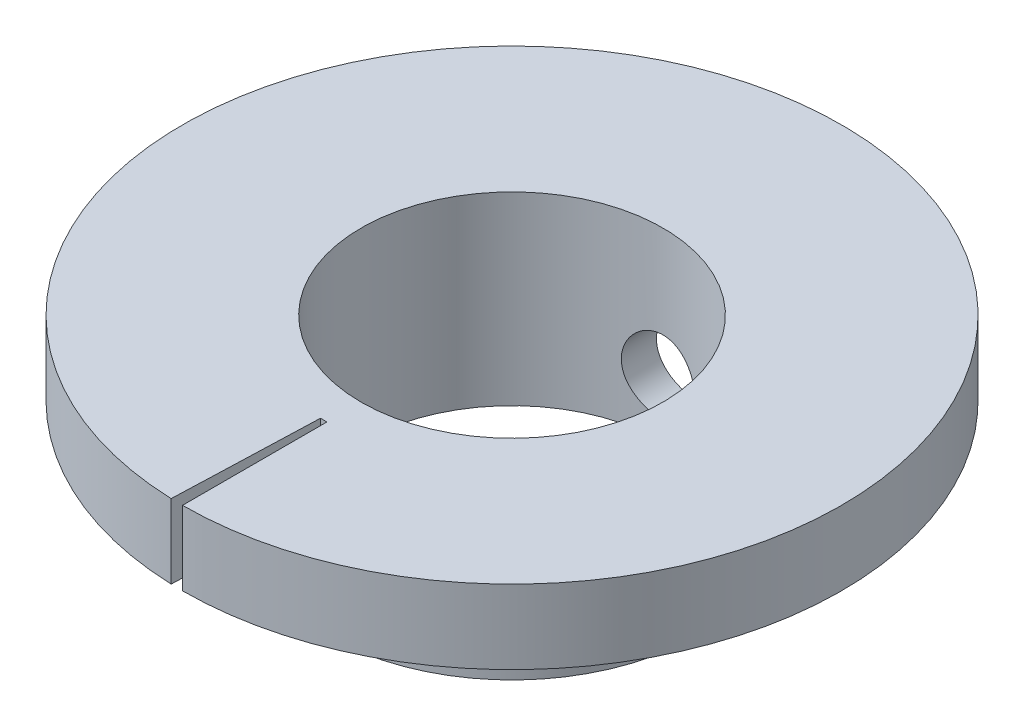
ISO-10303-21;
HEADER;
FILE_DESCRIPTION(('STEP AP214'),'2;1');
FILE_NAME('part.step','',(''),(''),'','','');
FILE_SCHEMA(('AUTOMOTIVE_DESIGN { 1 0 10303 214 1 1 1 1 }'));
ENDSEC;
DATA;
#1=APPLICATION_CONTEXT('core data for automotive mechanical design processes');
#2=APPLICATION_PROTOCOL_DEFINITION('international standard','automotive_design',2000,#1);
#3=PRODUCT_CONTEXT('',#1,'mechanical');
#4=PRODUCT('Part','Part','',(#3));
#5=PRODUCT_RELATED_PRODUCT_CATEGORY('part','',(#4));
#6=PRODUCT_DEFINITION_FORMATION('','',#4);
#7=PRODUCT_DEFINITION_CONTEXT('part definition',#1,'design');
#8=PRODUCT_DEFINITION('design','',#6,#7);
#9=PRODUCT_DEFINITION_SHAPE('','',#8);
#10=(LENGTH_UNIT() NAMED_UNIT(*) SI_UNIT(.MILLI.,.METRE.));
#11=(NAMED_UNIT(*) PLANE_ANGLE_UNIT() SI_UNIT($,.RADIAN.));
#12=(NAMED_UNIT(*) SI_UNIT($,.STERADIAN.) SOLID_ANGLE_UNIT());
#13=UNCERTAINTY_MEASURE_WITH_UNIT(LENGTH_MEASURE(1.E-05),#10,'distance_accuracy_value','');
#14=(GEOMETRIC_REPRESENTATION_CONTEXT(3) GLOBAL_UNCERTAINTY_ASSIGNED_CONTEXT((#13)) GLOBAL_UNIT_ASSIGNED_CONTEXT((#10,
#11,#12)) REPRESENTATION_CONTEXT('',''));
#15=CARTESIAN_POINT('',(0.,0.,0.));
#16=DIRECTION('',(0.,0.,1.));
#17=DIRECTION('',(1.,0.,0.));
#18=AXIS2_PLACEMENT_3D('',#15,#16,#17);
#19=CARTESIAN_POINT('',(0.,2.,0.));
#20=DIRECTION('',(0.,1.,0.));
#21=DIRECTION('',(0.,0.,1.));
#22=AXIS2_PLACEMENT_3D('',#19,#20,#21);
#23=PLANE('',#22);
#24=CARTESIAN_POINT('',(0.,2.,0.));
#25=DIRECTION('',(0.,1.,0.));
#26=DIRECTION('',(0.,0.,1.));
#27=AXIS2_PLACEMENT_3D('',#24,#25,#26);
#28=CIRCLE('',#27,4.075);
#29=CARTESIAN_POINT('',(0.,2.,4.075));
#30=VERTEX_POINT('',#29);
#31=EDGE_CURVE('E115',#30,#30,#28,.T.);
#32=ORIENTED_EDGE('',*,*,#31,.F.);
#33=EDGE_LOOP('',(#32));
#34=FACE_BOUND('',#33,.T.);
#35=DIRECTION('',(-0.0348994967024937,0.,0.999390827019096));
#36=VECTOR('',#35,1.);
#37=CARTESIAN_POINT('',(-0.355401251101973,2.,10.1773602436233));
#38=LINE('',#37,#36);
#39=CARTESIAN_POINT('',(-0.174497483512468,2.,4.99695413509548));
#40=VERTEX_POINT('',#39);
#41=CARTESIAN_POINT('',(-0.310605520652194,2.,8.89457836046995));
#42=VERTEX_POINT('',#41);
#43=EDGE_CURVE('E85',#40,#42,#38,.T.);
#44=ORIENTED_EDGE('',*,*,#43,.F.);
#45=CARTESIAN_POINT('',(0.,2.,0.));
#46=DIRECTION('',(0.,1.,0.));
#47=DIRECTION('',(0.,0.,1.));
#48=AXIS2_PLACEMENT_3D('',#45,#46,#47);
#49=CIRCLE('',#48,5.);
#50=CARTESIAN_POINT('',(0.,2.,5.));
#51=VERTEX_POINT('',#50);
#52=EDGE_CURVE('E114',#40,#51,#49,.T.);
#53=ORIENTED_EDGE('',*,*,#52,.T.);
#54=DIRECTION('',(0.,0.,-1.));
#55=VECTOR('',#54,1.);
#56=CARTESIAN_POINT('',(0.,2.,0.));
#57=LINE('',#56,#55);
#58=CARTESIAN_POINT('',(0.,2.,8.9));
#59=VERTEX_POINT('',#58);
#60=EDGE_CURVE('E67',#59,#51,#57,.T.);
#61=ORIENTED_EDGE('',*,*,#60,.F.);
#62=CARTESIAN_POINT('',(0.,2.,0.));
#63=DIRECTION('',(0.,1.,0.));
#64=DIRECTION('',(0.,0.,1.));
#65=AXIS2_PLACEMENT_3D('',#62,#63,#64);
#66=CIRCLE('',#65,8.9);
#67=EDGE_CURVE('E54',#59,#42,#66,.T.);
#68=ORIENTED_EDGE('',*,*,#67,.T.);
#69=EDGE_LOOP('',(#44,#53,#61,#68));
#70=FACE_BOUND('',#69,.T.);
#71=ADVANCED_FACE('F39',(#34,#70),#23,.T.);
#72=CARTESIAN_POINT('',(0.,0.,0.));
#73=DIRECTION('',(0.,1.,0.));
#74=DIRECTION('',(0.,0.,1.));
#75=AXIS2_PLACEMENT_3D('',#72,#73,#74);
#76=PLANE('',#75);
#77=DIRECTION('',(0.,0.,-1.));
#78=VECTOR('',#77,1.);
#79=CARTESIAN_POINT('',(0.,0.,0.));
#80=LINE('',#79,#78);
#81=CARTESIAN_POINT('',(0.,0.,8.9));
#82=VERTEX_POINT('',#81);
#83=CARTESIAN_POINT('',(0.,0.,5.));
#84=VERTEX_POINT('',#83);
#85=EDGE_CURVE('E146',#82,#84,#80,.T.);
#86=ORIENTED_EDGE('',*,*,#85,.T.);
#87=CARTESIAN_POINT('',(0.,0.,0.));
#88=DIRECTION('',(0.,1.,0.));
#89=DIRECTION('',(0.,0.,1.));
#90=AXIS2_PLACEMENT_3D('',#87,#88,#89);
#91=CIRCLE('',#90,5.);
#92=CARTESIAN_POINT('',(-0.174497483512468,0.,4.99695413509548));
#93=VERTEX_POINT('',#92);
#94=EDGE_CURVE('E137',#84,#93,#91,.T.);
#95=ORIENTED_EDGE('',*,*,#94,.T.);
#96=DIRECTION('',(-0.0348994967024937,0.,0.999390827019096));
#97=VECTOR('',#96,1.);
#98=CARTESIAN_POINT('',(-0.355401251101973,0.,10.1773602436233));
#99=LINE('',#98,#97);
#100=CARTESIAN_POINT('',(-0.310605520652194,0.,8.89457836046995));
#101=VERTEX_POINT('',#100);
#102=EDGE_CURVE('E143',#93,#101,#99,.T.);
#103=ORIENTED_EDGE('',*,*,#102,.T.);
#104=CARTESIAN_POINT('',(0.,0.,0.));
#105=DIRECTION('',(0.,1.,0.));
#106=DIRECTION('',(0.,0.,1.));
#107=AXIS2_PLACEMENT_3D('',#104,#105,#106);
#108=CIRCLE('',#107,8.9);
#109=EDGE_CURVE('E102',#82,#101,#108,.T.);
#110=ORIENTED_EDGE('',*,*,#109,.F.);
#111=EDGE_LOOP('',(#86,#95,#103,#110));
#112=FACE_BOUND('',#111,.T.);
#113=ADVANCED_FACE('F152',(#112),#76,.F.);
#114=CARTESIAN_POINT('',(0.,2.,0.));
#115=DIRECTION('',(0.,-1.,0.));
#116=DIRECTION('',(0.,0.,-1.));
#117=AXIS2_PLACEMENT_3D('',#114,#115,#116);
#118=CYLINDRICAL_SURFACE('',#117,8.9);
#119=ORIENTED_EDGE('',*,*,#109,.T.);
#120=DIRECTION('',(0.,-1.,0.));
#121=VECTOR('',#120,1.);
#122=CARTESIAN_POINT('',(-0.310605520652194,2.,8.89457836046996));
#123=LINE('',#122,#121);
#124=EDGE_CURVE('E89',#101,#42,#123,.F.);
#125=ORIENTED_EDGE('',*,*,#124,.T.);
#126=ORIENTED_EDGE('',*,*,#67,.F.);
#127=DIRECTION('',(0.,-1.,0.));
#128=VECTOR('',#127,1.);
#129=CARTESIAN_POINT('',(0.,2.,8.9));
#130=LINE('',#129,#128);
#131=EDGE_CURVE('E104',#59,#82,#130,.T.);
#132=ORIENTED_EDGE('',*,*,#131,.T.);
#133=EDGE_LOOP('',(#119,#125,#126,#132));
#134=FACE_BOUND('',#133,.T.);
#135=ADVANCED_FACE('F41',(#134),#118,.T.);
#136=CARTESIAN_POINT('',(0.,0.,0.));
#137=DIRECTION('',(1.,0.,0.));
#138=DIRECTION('',(0.,0.,-1.));
#139=AXIS2_PLACEMENT_3D('',#136,#137,#138);
#140=PLANE('',#139);
#141=ORIENTED_EDGE('',*,*,#60,.T.);
#142=DIRECTION('',(0.,1.,0.));
#143=VECTOR('',#142,1.);
#144=CARTESIAN_POINT('',(0.,-3.,5.));
#145=LINE('',#144,#143);
#146=EDGE_CURVE('E62',#51,#84,#145,.F.);
#147=ORIENTED_EDGE('',*,*,#146,.T.);
#148=ORIENTED_EDGE('',*,*,#85,.F.);
#149=ORIENTED_EDGE('',*,*,#131,.F.);
#150=EDGE_LOOP('',(#141,#147,#148,#149));
#151=FACE_BOUND('',#150,.T.);
#152=ADVANCED_FACE('F165',(#151),#140,.F.);
#153=CARTESIAN_POINT('',(-0.355401251101973,0.,10.1773602436233));
#154=DIRECTION('',(-0.999390827019096,0.,-0.0348994967024937));
#155=DIRECTION('',(-0.0348994967024937,0.,0.999390827019096));
#156=AXIS2_PLACEMENT_3D('',#153,#154,#155);
#157=PLANE('',#156);
#158=ORIENTED_EDGE('',*,*,#102,.F.);
#159=DIRECTION('',(0.,1.,0.));
#160=VECTOR('',#159,1.);
#161=CARTESIAN_POINT('',(-0.174497483512468,-3.,4.99695413509548));
#162=LINE('',#161,#160);
#163=EDGE_CURVE('E11',#93,#40,#162,.T.);
#164=ORIENTED_EDGE('',*,*,#163,.T.);
#165=ORIENTED_EDGE('',*,*,#43,.T.);
#166=ORIENTED_EDGE('',*,*,#124,.F.);
#167=EDGE_LOOP('',(#158,#164,#165,#166));
#168=FACE_BOUND('',#167,.T.);
#169=ADVANCED_FACE('F88',(#168),#157,.F.);
#170=CARTESIAN_POINT('',(0.,-3.,0.));
#171=DIRECTION('',(0.,1.,0.));
#172=DIRECTION('',(0.,0.,1.));
#173=AXIS2_PLACEMENT_3D('',#170,#171,#172);
#174=CYLINDRICAL_SURFACE('',#173,5.);
#175=CARTESIAN_POINT('',(1.,-1.5,-4.89897948556636));
#176=CARTESIAN_POINT('',(0.999997945876045,-1.55556437548198,-4.89898059043933));
#177=CARTESIAN_POINT('',(0.995353171723656,-1.61115462330649,-4.89993508346913));
#178=CARTESIAN_POINT('',(0.976912283588335,-1.72076250511841,-4.90364431385263));
#179=CARTESIAN_POINT('',(0.963108847071181,-1.77477884463107,-4.90640049166333));
#180=CARTESIAN_POINT('',(0.926795782617738,-1.87963730336293,-4.91338873700356));
#181=CARTESIAN_POINT('',(0.904294814152083,-1.93048252153493,-4.91761933615313));
#182=CARTESIAN_POINT('',(0.851249107671043,-2.02767484469462,-4.92707799486421));
#183=CARTESIAN_POINT('',(0.820704818601296,-2.07402220053727,-4.93230599875014));
#184=CARTESIAN_POINT('',(0.75197907565329,-2.1615610038545,-4.9432529969268));
#185=CARTESIAN_POINT('',(0.713705655913279,-2.20267958788414,-4.94897737836825));
#186=CARTESIAN_POINT('',(0.63080678902135,-2.27795753357881,-4.9602247230302));
#187=CARTESIAN_POINT('',(0.586180896977995,-2.31211640741715,-4.96574767210945));
#188=CARTESIAN_POINT('',(0.491361355924245,-2.37278801762851,-4.97602796417448));
#189=CARTESIAN_POINT('',(0.441122567672208,-2.39923151381665,-4.9807782144152));
#190=CARTESIAN_POINT('',(0.336804150387274,-2.44327493704812,-4.98891736883662));
#191=CARTESIAN_POINT('',(0.282724881420554,-2.46087569190099,-4.99230640044127));
#192=CARTESIAN_POINT('',(0.173016773278494,-2.48650719361963,-4.9973032068841));
#193=CARTESIAN_POINT('',(0.117417739214814,-2.49466097757101,-4.99893386288125));
#194=CARTESIAN_POINT('',(0.00561856843753677,-2.50155095183831,-5.00030921183606));
#195=CARTESIAN_POINT('',(-0.0505815098318428,-2.50028804964582,-5.00005408652759));
#196=CARTESIAN_POINT('',(-0.161142000743588,-2.48847381978445,-4.99770434868515));
#197=CARTESIAN_POINT('',(-0.21551721429847,-2.47805502283215,-4.99563598365838));
#198=CARTESIAN_POINT('',(-0.321731626580301,-2.44843496754111,-4.98992177159409));
#199=CARTESIAN_POINT('',(-0.373570723747129,-2.42923335780813,-4.98627586144039));
#200=CARTESIAN_POINT('',(-0.473619463200887,-2.38246995985273,-4.97777296019958));
#201=CARTESIAN_POINT('',(-0.5218041741339,-2.35485624889511,-4.97290848175223));
#202=CARTESIAN_POINT('',(-0.612905045859756,-2.2920909227634,-4.96250469473785));
#203=CARTESIAN_POINT('',(-0.655820599525001,-2.25693844022948,-4.95696530855222));
#204=CARTESIAN_POINT('',(-0.735951431053457,-2.17936637789153,-4.9457096436446));
#205=CARTESIAN_POINT('',(-0.773054316573631,-2.13683081327041,-4.93999196457516));
#206=CARTESIAN_POINT('',(-0.839618493176807,-2.04608355754925,-4.92911571598761));
#207=CARTESIAN_POINT('',(-0.869079639727751,-1.9978717591168,-4.92395715704548));
#208=CARTESIAN_POINT('',(-0.919562814801882,-1.89697916817819,-4.91478047472924));
#209=CARTESIAN_POINT('',(-0.940566647777709,-1.84428903236034,-4.91076481563549));
#210=CARTESIAN_POINT('',(-0.973390341627582,-1.73602867627601,-4.90436476321273));
#211=CARTESIAN_POINT('',(-0.985211399456642,-1.68045883238092,-4.90198015728428));
#212=CARTESIAN_POINT('',(-0.999166006036051,-1.56903514200096,-4.89915479267828));
#213=CARTESIAN_POINT('',(-1.00146185889791,-1.51320242568966,-4.89868147057154));
#214=CARTESIAN_POINT('',(-0.996737628310738,-1.40195177680032,-4.89964485688854));
#215=CARTESIAN_POINT('',(-0.989718073122442,-1.34653382088114,-4.90108145700388));
#216=CARTESIAN_POINT('',(-0.966702208074157,-1.23823135970776,-4.90567232494915));
#217=CARTESIAN_POINT('',(-0.950792620839298,-1.18532765696424,-4.90880999014497));
#218=CARTESIAN_POINT('',(-0.910541035308518,-1.08293672097126,-4.91643489351665));
#219=CARTESIAN_POINT('',(-0.886198342373177,-1.03344976956428,-4.9209222428627));
#220=CARTESIAN_POINT('',(-0.829404142215598,-0.938586890049839,-4.93081405962039));
#221=CARTESIAN_POINT('',(-0.796851077982754,-0.893272953699173,-4.93622971864903));
#222=CARTESIAN_POINT('',(-0.724695572212712,-0.808691687999085,-4.94733723826636));
#223=CARTESIAN_POINT('',(-0.685092405144537,-0.769424981750745,-4.95302912723818));
#224=CARTESIAN_POINT('',(-0.599232273497891,-0.697437440814423,-4.96415345869216));
#225=CARTESIAN_POINT('',(-0.55288249892963,-0.664826345350004,-4.96958057708684));
#226=CARTESIAN_POINT('',(-0.455267896634756,-0.607854118500417,-4.9794712762862));
#227=CARTESIAN_POINT('',(-0.404003275433507,-0.583492640655218,-4.98393489755211));
#228=CARTESIAN_POINT('',(-0.298302680824013,-0.543871128253366,-4.99137294061067));
#229=CARTESIAN_POINT('',(-0.243886673478077,-0.528559481773748,-4.99435579142604));
#230=CARTESIAN_POINT('',(-0.133189454679912,-0.507308752336155,-4.9985323593766));
#231=CARTESIAN_POINT('',(-0.0769084687112139,-0.501368540524317,-4.99972629199843));
#232=CARTESIAN_POINT('',(0.0348728939036236,-0.499073019037114,-5.00018540454121));
#233=CARTESIAN_POINT('',(0.0903698121415027,-0.502552719543788,-4.99948378549351));
#234=CARTESIAN_POINT('',(0.199971031315642,-0.518633950547812,-4.99630043560318));
#235=CARTESIAN_POINT('',(0.254075349753691,-0.531235366348075,-4.99381872714351));
#236=CARTESIAN_POINT('',(0.359252749745096,-0.565128992091644,-4.98735498365001));
#237=CARTESIAN_POINT('',(0.410332443240281,-0.586401378131184,-4.98337637247912));
#238=CARTESIAN_POINT('',(0.508221220185953,-0.6370122413309,-4.97434722123382));
#239=CARTESIAN_POINT('',(0.555029965767411,-0.666351355903716,-4.96929659645878));
#240=CARTESIAN_POINT('',(0.643863890106357,-0.732819387062081,-4.95857599157868));
#241=CARTESIAN_POINT('',(0.685799716116504,-0.770066336386769,-4.95289733422142));
#242=CARTESIAN_POINT('',(0.762882617756846,-0.851050240095775,-4.94161222903622));
#243=CARTESIAN_POINT('',(0.798028083202712,-0.894788729468738,-4.93600579862875));
#244=CARTESIAN_POINT('',(0.8608922194552,-0.988079316700178,-4.92543342749964));
#245=CARTESIAN_POINT('',(0.888526814639767,-1.03768896116037,-4.92047503631328));
#246=CARTESIAN_POINT('',(0.935024049287808,-1.14093277329969,-4.91185237184445));
#247=CARTESIAN_POINT('',(0.95389464597929,-1.19456323869792,-4.90818692536957));
#248=CARTESIAN_POINT('',(0.978669139854273,-1.29026245543657,-4.90329681128922));
#249=CARTESIAN_POINT('',(0.986653898522985,-1.33178541951146,-4.90168784915661));
#250=CARTESIAN_POINT('',(0.997320017960409,-1.41553395455364,-4.8995287845803));
#251=CARTESIAN_POINT('',(1.00000156156205,-1.45775950124817,-4.89897864563277));
#252=CARTESIAN_POINT('',(1.,-1.5,-4.89897948556636));
#253=B_SPLINE_CURVE_WITH_KNOTS('',3,(#175,#176,#177,#178,#179,#180,#181,#182,#183,#184,#185,
#186,#187,#188,#189,#190,#191,#192,#193,#194,#195,#196,#197,#198,#199,#200,#201,#202,#203,#204,
#205,#206,#207,#208,#209,#210,#211,#212,#213,#214,#215,#216,#217,#218,#219,#220,#221,#222,#223,
#224,#225,#226,#227,#228,#229,#230,#231,#232,#233,#234,#235,#236,#237,#238,#239,#240,#241,#242,
#243,#244,#245,#246,#247,#248,#249,#250,#251,#252),.UNSPECIFIED.,.T.,.F.,(4,2,2,2,2,2,2,2,2,2,2,
2,2,2,2,2,2,2,2,2,2,2,2,2,2,2,2,2,2,2,2,2,2,2,2,2,2,2,4),(0.,0.166538463856524,
0.333210239259264,0.499716497915553,0.666213464834831,0.834822525459335,1.00344340032919,
1.17353400434947,1.34360868244057,1.51144248880577,1.67926012113745,1.84468789631034,
2.01012229071247,2.176599242198,2.34309535767563,2.5124934675998,2.68189478120217,
2.85165863170273,3.02140035013522,3.1882375780209,3.35506534525918,3.52029341780816,
3.68553510351895,3.85293059772018,4.02034332867706,4.19032601730948,4.36030156627602,
4.52929813576147,4.69827434689125,4.86431017412183,5.03034391364254,5.19600017072949,
5.36166952132181,5.53001152023094,5.69839338887278,5.86858898576538,6.0386297508643,
6.16523803634393,6.29184195681712),.UNSPECIFIED.);
#254=CARTESIAN_POINT('',(1.,-1.5,-4.89897948556636));
#255=VERTEX_POINT('',#254);
#256=EDGE_CURVE('E123',#255,#255,#253,.T.);
#257=ORIENTED_EDGE('',*,*,#256,.F.);
#258=EDGE_LOOP('',(#257));
#259=FACE_BOUND('',#258,.T.);
#260=CARTESIAN_POINT('',(0.,-3.,0.));
#261=DIRECTION('',(0.,1.,0.));
#262=DIRECTION('',(0.,0.,1.));
#263=AXIS2_PLACEMENT_3D('',#260,#261,#262);
#264=CIRCLE('',#263,5.);
#265=CARTESIAN_POINT('',(0.,-3.,5.));
#266=VERTEX_POINT('',#265);
#267=EDGE_CURVE('E120',#266,#266,#264,.T.);
#268=ORIENTED_EDGE('',*,*,#267,.T.);
#269=EDGE_LOOP('',(#268));
#270=FACE_BOUND('',#269,.T.);
#271=ORIENTED_EDGE('',*,*,#146,.F.);
#272=ORIENTED_EDGE('',*,*,#52,.F.);
#273=ORIENTED_EDGE('',*,*,#163,.F.);
#274=ORIENTED_EDGE('',*,*,#94,.F.);
#275=EDGE_LOOP('',(#271,#272,#273,#274));
#276=FACE_BOUND('',#275,.T.);
#277=ADVANCED_FACE('F155',(#259,#270,#276),#174,.T.);
#278=CARTESIAN_POINT('',(0.,-3.,0.));
#279=DIRECTION('',(0.,1.,0.));
#280=DIRECTION('',(0.,0.,1.));
#281=AXIS2_PLACEMENT_3D('',#278,#279,#280);
#282=PLANE('',#281);
#283=CARTESIAN_POINT('',(0.,-3.,0.));
#284=DIRECTION('',(0.,1.,0.));
#285=DIRECTION('',(0.,0.,1.));
#286=AXIS2_PLACEMENT_3D('',#283,#284,#285);
#287=CIRCLE('',#286,4.075);
#288=CARTESIAN_POINT('',(0.,-3.,4.075));
#289=VERTEX_POINT('',#288);
#290=EDGE_CURVE('E111',#289,#289,#287,.T.);
#291=ORIENTED_EDGE('',*,*,#290,.T.);
#292=EDGE_LOOP('',(#291));
#293=FACE_BOUND('',#292,.T.);
#294=ORIENTED_EDGE('',*,*,#267,.F.);
#295=EDGE_LOOP('',(#294));
#296=FACE_BOUND('',#295,.T.);
#297=ADVANCED_FACE('F157',(#293,#296),#282,.F.);
#298=CARTESIAN_POINT('',(0.,-13.,0.));
#299=DIRECTION('',(0.,1.,0.));
#300=DIRECTION('',(0.,0.,1.));
#301=AXIS2_PLACEMENT_3D('',#298,#299,#300);
#302=CYLINDRICAL_SURFACE('',#301,4.075);
#303=CARTESIAN_POINT('',(1.,-1.5,-3.95039554981523));
#304=CARTESIAN_POINT('',(0.999998373158146,-1.55525526835198,-3.95039662286157));
#305=CARTESIAN_POINT('',(0.995404685938842,-1.61052876429278,-3.95156751184588));
#306=CARTESIAN_POINT('',(0.977179163297583,-1.71949087395198,-3.95611312052526));
#307=CARTESIAN_POINT('',(0.963541872553182,-1.77317851061047,-3.95948917040873));
#308=CARTESIAN_POINT('',(0.927695141217161,-1.87737706936861,-3.96804024073275));
#309=CARTESIAN_POINT('',(0.905496507002707,-1.92789190317533,-3.97321299250903));
#310=CARTESIAN_POINT('',(0.853189860297674,-2.02448526032043,-3.98477181909573));
#311=CARTESIAN_POINT('',(0.823081587605975,-2.07056363764581,-3.99115793381988));
#312=CARTESIAN_POINT('',(0.755128405740938,-2.15795347902223,-4.00457552390117));
#313=CARTESIAN_POINT('',(0.717146616720325,-2.19915699211867,-4.01161700164901));
#314=CARTESIAN_POINT('',(0.634819504141657,-2.27467732967829,-4.02546503154431));
#315=CARTESIAN_POINT('',(0.59047360270618,-2.30899352807653,-4.03227156228829));
#316=CARTESIAN_POINT('',(0.495939950957729,-2.37020453356199,-4.0449931911479));
#317=CARTESIAN_POINT('',(0.445681826801948,-2.39699363212048,-4.05089510900223));
#318=CARTESIAN_POINT('',(0.341206945477128,-2.44170320542756,-4.06102858775097));
#319=CARTESIAN_POINT('',(0.2869907517025,-2.45962493954957,-4.0652603858242));
#320=CARTESIAN_POINT('',(0.177263711769043,-2.48574624197115,-4.0715061101663));
#321=CARTESIAN_POINT('',(0.12179890169568,-2.49412903962494,-4.07356178086943));
#322=CARTESIAN_POINT('',(0.0102146875004002,-2.50150930750408,-4.0753689718621));
#323=CARTESIAN_POINT('',(-0.0459046220923086,-2.50050811669367,-4.07512082087491));
#324=CARTESIAN_POINT('',(-0.155935209585297,-2.48928133737388,-4.07237953156616));
#325=CARTESIAN_POINT('',(-0.209868041629481,-2.47925348159649,-4.06993451849035));
#326=CARTESIAN_POINT('',(-0.315260861633298,-2.45057543180946,-4.06313007214777));
#327=CARTESIAN_POINT('',(-0.366720720550988,-2.43192478839322,-4.0587705390997));
#328=CARTESIAN_POINT('',(-0.466232091804297,-2.38636832584098,-4.04855268426097));
#329=CARTESIAN_POINT('',(-0.514249695983963,-2.35939143475232,-4.04268153392563));
#330=CARTESIAN_POINT('',(-0.60514610572194,-2.29800201264885,-4.03007840557035));
#331=CARTESIAN_POINT('',(-0.648024044659274,-2.26358823040215,-4.02334628277259));
#332=CARTESIAN_POINT('',(-0.72860283296735,-2.18723927818374,-4.00954856801676));
#333=CARTESIAN_POINT('',(-0.766139373171173,-2.14513125979886,-4.0024788584504));
#334=CARTESIAN_POINT('',(-0.833654066141567,-2.05514410508007,-3.98896412469254));
#335=CARTESIAN_POINT('',(-0.863631891559783,-2.00726471893585,-3.98251912756316));
#336=CARTESIAN_POINT('',(-0.915278264783019,-1.90678052788631,-3.9709693335184));
#337=CARTESIAN_POINT('',(-0.936908591122129,-1.85415531673478,-3.96587073430593));
#338=CARTESIAN_POINT('',(-0.970964855711819,-1.74586044263411,-3.95767133466747));
#339=CARTESIAN_POINT('',(-0.983392682475262,-1.69019140685017,-3.95457012435956));
#340=CARTESIAN_POINT('',(-0.998421338466932,-1.57890944677747,-3.9508023019728));
#341=CARTESIAN_POINT('',(-1.00126453482246,-1.52333124803338,-3.95007565889684));
#342=CARTESIAN_POINT('',(-0.997705619103173,-1.41249458420991,-3.95097606461794));
#343=CARTESIAN_POINT('',(-0.991304323707401,-1.35723609131997,-3.95260290550299));
#344=CARTESIAN_POINT('',(-0.969650317629939,-1.24949858854416,-3.95796957736654));
#345=CARTESIAN_POINT('',(-0.954537521687589,-1.19698963443367,-3.96167598408836));
#346=CARTESIAN_POINT('',(-0.916044069814742,-1.0952501591846,-3.97075268011842));
#347=CARTESIAN_POINT('',(-0.89266246224457,-1.0460200161726,-3.97612316093254));
#348=CARTESIAN_POINT('',(-0.837783720546895,-0.951205296202832,-3.98805012797746));
#349=CARTESIAN_POINT('',(-0.806140999109624,-0.905707629698199,-3.99462718688526));
#350=CARTESIAN_POINT('',(-0.73582331430938,-0.820578879587824,-4.00817520077781));
#351=CARTESIAN_POINT('',(-0.697147239319007,-0.780948725146056,-4.01514621790778));
#352=CARTESIAN_POINT('',(-0.612750781949017,-0.707704559441533,-4.02889928369823));
#353=CARTESIAN_POINT('',(-0.566883560909017,-0.674257843035331,-4.03567277648955));
#354=CARTESIAN_POINT('',(-0.470042515109937,-0.615542077166453,-4.04809393921629));
#355=CARTESIAN_POINT('',(-0.41906895406765,-0.590272605675024,-4.05374166724679));
#356=CARTESIAN_POINT('',(-0.313810984089158,-0.548843955479443,-4.06323974097069));
#357=CARTESIAN_POINT('',(-0.259553202659138,-0.532620175097182,-4.06710279733933));
#358=CARTESIAN_POINT('',(-0.148974451943248,-0.509548076278793,-4.07265181548473));
#359=CARTESIAN_POINT('',(-0.0926538673586032,-0.50269801874519,-4.07433818109747));
#360=CARTESIAN_POINT('',(0.0188776620983647,-0.498662642258223,-4.07532801870577));
#361=CARTESIAN_POINT('',(0.0740792559204324,-0.501230012250779,-4.07469246831588));
#362=CARTESIAN_POINT('',(0.18323883969971,-0.515392212922731,-4.0712443960205));
#363=CARTESIAN_POINT('',(0.237196864160915,-0.526986792822527,-4.0684319345905));
#364=CARTESIAN_POINT('',(0.34208914321367,-0.558743688616061,-4.06095474363675));
#365=CARTESIAN_POINT('',(0.393037201975385,-0.578862756128716,-4.05629937171487));
#366=CARTESIAN_POINT('',(0.490863059165569,-0.627058001309578,-4.04562757992771));
#367=CARTESIAN_POINT('',(0.537740360298905,-0.655135149377719,-4.0396109940955));
#368=CARTESIAN_POINT('',(0.627272100726372,-0.719211886163362,-4.02669219585314));
#369=CARTESIAN_POINT('',(0.669803252251274,-0.755380252366521,-4.01977266711069));
#370=CARTESIAN_POINT('',(0.748276574182533,-0.8342830480635,-4.00590796494284));
#371=CARTESIAN_POINT('',(0.784217086625328,-0.877019124796662,-3.99896278551171));
#372=CARTESIAN_POINT('',(0.849115401996452,-0.968759941607044,-3.98569283802229));
#373=CARTESIAN_POINT('',(0.877937523999795,-1.01786272414229,-3.979381313934));
#374=CARTESIAN_POINT('',(0.926874626627724,-1.12036404168482,-3.96826947809607));
#375=CARTESIAN_POINT('',(0.946996107259252,-1.17375933438671,-3.96346803893777));
#376=CARTESIAN_POINT('',(0.974870999338224,-1.27257149277445,-3.95669216017046));
#377=CARTESIAN_POINT('',(0.984274233813886,-1.31750473666421,-3.95434836162083));
#378=CARTESIAN_POINT('',(0.996839163817745,-1.40828784954385,-3.95119967164791));
#379=CARTESIAN_POINT('',(1.0000013502929,-1.45413764614723,-3.95039465917743));
#380=CARTESIAN_POINT('',(1.,-1.5,-3.95039554981523));
#381=B_SPLINE_CURVE_WITH_KNOTS('',3,(#303,#304,#305,#306,#307,#308,#309,#310,#311,#312,#313,
#314,#315,#316,#317,#318,#319,#320,#321,#322,#323,#324,#325,#326,#327,#328,#329,#330,#331,#332,
#333,#334,#335,#336,#337,#338,#339,#340,#341,#342,#343,#344,#345,#346,#347,#348,#349,#350,#351,
#352,#353,#354,#355,#356,#357,#358,#359,#360,#361,#362,#363,#364,#365,#366,#367,#368,#369,#370,
#371,#372,#373,#374,#375,#376,#377,#378,#379,#380),.UNSPECIFIED.,.T.,.F.,(4,2,2,2,2,2,2,2,2,2,2,
2,2,2,2,2,2,2,2,2,2,2,2,2,2,2,2,2,2,2,2,2,2,2,2,2,2,2,4),(0.,0.165597439812446,0.33129486301958,
0.496783819023176,0.662278219751599,0.830935922782012,0.999608950057517,1.17054421938573,
1.34145520492911,1.50902467716009,1.67657023992915,1.84053263971597,2.00450358593764,
2.16991480222869,2.33535387009699,2.50511041234154,2.67487430503991,2.84540654099296,
3.01590377106083,3.18205592029864,3.34819339218245,3.51173407477736,3.67529358504468,
3.84195694828649,4.00864667574182,4.17933865014705,4.3500218137101,4.51946986117478,
4.68888646684757,4.853886255544,5.01888146064205,5.18304941278836,5.34723739201996,
5.51523674261823,5.6832782978995,5.8543110193795,6.025215745386,6.16267387578924,
6.30012119272947),.UNSPECIFIED.);
#382=CARTESIAN_POINT('',(1.,-1.5,-3.95039554981523));
#383=VERTEX_POINT('',#382);
#384=EDGE_CURVE('E43',#383,#383,#381,.T.);
#385=ORIENTED_EDGE('',*,*,#384,.T.);
#386=EDGE_LOOP('',(#385));
#387=FACE_BOUND('',#386,.T.);
#388=ORIENTED_EDGE('',*,*,#31,.T.);
#389=EDGE_LOOP('',(#388));
#390=FACE_BOUND('',#389,.T.);
#391=ORIENTED_EDGE('',*,*,#290,.F.);
#392=EDGE_LOOP('',(#391));
#393=FACE_BOUND('',#392,.T.);
#394=ADVANCED_FACE('F163',(#387,#390,#393),#302,.F.);
#395=CARTESIAN_POINT('',(0.,-1.5,-15.));
#396=DIRECTION('',(0.,0.,1.));
#397=DIRECTION('',(1.,0.,0.));
#398=AXIS2_PLACEMENT_3D('',#395,#396,#397);
#399=CYLINDRICAL_SURFACE('',#398,1.);
#400=ORIENTED_EDGE('',*,*,#256,.T.);
#401=EDGE_LOOP('',(#400));
#402=FACE_BOUND('',#401,.T.);
#403=ORIENTED_EDGE('',*,*,#384,.F.);
#404=EDGE_LOOP('',(#403));
#405=FACE_BOUND('',#404,.T.);
#406=ADVANCED_FACE('F221',(#402,#405),#399,.F.);
#407=CLOSED_SHELL('',(#71,#113,#135,#152,#169,#277,#297,#394,#406));
#408=MANIFOLD_SOLID_BREP('B2',#407);
#409=ADVANCED_BREP_SHAPE_REPRESENTATION('',(#18,#408),#14);
#410=SHAPE_DEFINITION_REPRESENTATION(#9,#409);
ENDSEC;
END-ISO-10303-21;
